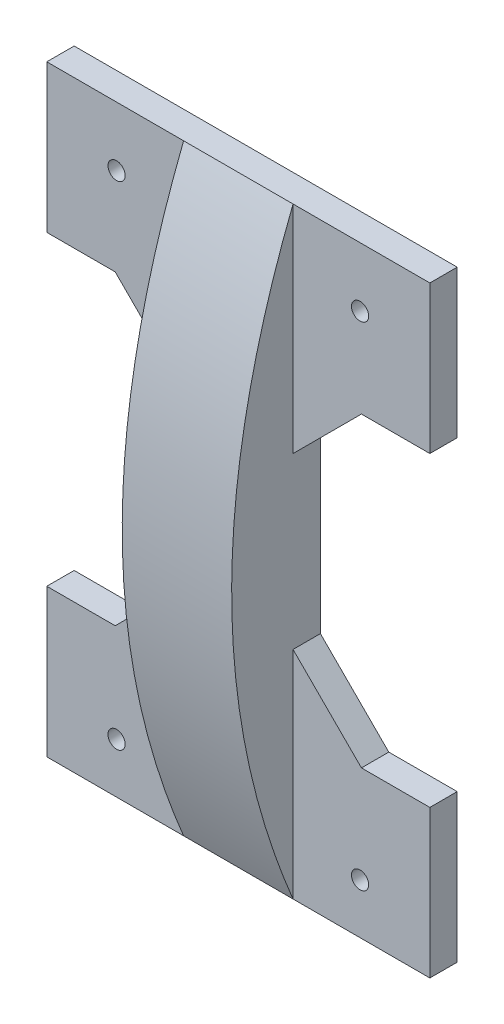
ISO-10303-21;
HEADER;
FILE_DESCRIPTION(('STEP AP214'),'2;1');
FILE_NAME('part.step','',(''),(''),'','','');
FILE_SCHEMA(('AUTOMOTIVE_DESIGN { 1 0 10303 214 1 1 1 1 }'));
ENDSEC;
DATA;
#1=APPLICATION_CONTEXT('core data for automotive mechanical design processes');
#2=APPLICATION_PROTOCOL_DEFINITION('international standard','automotive_design',2000,#1);
#3=PRODUCT_CONTEXT('',#1,'mechanical');
#4=PRODUCT('Part','Part','',(#3));
#5=PRODUCT_RELATED_PRODUCT_CATEGORY('part','',(#4));
#6=PRODUCT_DEFINITION_FORMATION('','',#4);
#7=PRODUCT_DEFINITION_CONTEXT('part definition',#1,'design');
#8=PRODUCT_DEFINITION('design','',#6,#7);
#9=PRODUCT_DEFINITION_SHAPE('','',#8);
#10=(LENGTH_UNIT() NAMED_UNIT(*) SI_UNIT(.MILLI.,.METRE.));
#11=(NAMED_UNIT(*) PLANE_ANGLE_UNIT() SI_UNIT($,.RADIAN.));
#12=(NAMED_UNIT(*) SI_UNIT($,.STERADIAN.) SOLID_ANGLE_UNIT());
#13=UNCERTAINTY_MEASURE_WITH_UNIT(LENGTH_MEASURE(1.E-05),#10,'distance_accuracy_value','');
#14=(GEOMETRIC_REPRESENTATION_CONTEXT(3) GLOBAL_UNCERTAINTY_ASSIGNED_CONTEXT((#13)) GLOBAL_UNIT_ASSIGNED_CONTEXT((#10,
#11,#12)) REPRESENTATION_CONTEXT('',''));
#15=CARTESIAN_POINT('',(0.,0.,0.));
#16=DIRECTION('',(0.,0.,1.));
#17=DIRECTION('',(1.,0.,0.));
#18=AXIS2_PLACEMENT_3D('',#15,#16,#17);
#19=CARTESIAN_POINT('',(0.,0.,5.));
#20=DIRECTION('',(0.,0.,1.));
#21=DIRECTION('',(1.,0.,0.));
#22=AXIS2_PLACEMENT_3D('',#19,#20,#21);
#23=PLANE('',#22);
#24=DIRECTION('',(0.,1.,0.));
#25=VECTOR('',#24,1.);
#26=CARTESIAN_POINT('',(-17.6713214485088,44.6574210010278,5.));
#27=LINE('',#26,#25);
#28=CARTESIAN_POINT('',(-17.6713214485088,5.15742100102772,5.));
#29=VERTEX_POINT('',#28);
#30=CARTESIAN_POINT('',(-17.6713214485088,44.6574210010278,5.));
#31=VERTEX_POINT('',#30);
#32=EDGE_CURVE('E172',#29,#31,#27,.T.);
#33=ORIENTED_EDGE('',*,*,#32,.T.);
#34=DIRECTION('',(-1.,0.,0.));
#35=VECTOR('',#34,1.);
#36=CARTESIAN_POINT('',(-42.6713214485088,44.6574210010278,5.));
#37=LINE('',#36,#35);
#38=CARTESIAN_POINT('',(-42.6713214485088,44.6574210010278,5.));
#39=VERTEX_POINT('',#38);
#40=EDGE_CURVE('E208',#31,#39,#37,.T.);
#41=ORIENTED_EDGE('',*,*,#40,.T.);
#42=DIRECTION('',(0.,-1.,0.));
#43=VECTOR('',#42,1.);
#44=CARTESIAN_POINT('',(-42.6713214485088,44.6574210010278,5.));
#45=LINE('',#44,#43);
#46=CARTESIAN_POINT('',(-42.6713214485088,17.6574210010278,5.));
#47=VERTEX_POINT('',#46);
#48=EDGE_CURVE('E203',#39,#47,#45,.T.);
#49=ORIENTED_EDGE('',*,*,#48,.T.);
#50=DIRECTION('',(-1.,0.,0.));
#51=VECTOR('',#50,1.);
#52=CARTESIAN_POINT('',(-42.6713214485088,17.6574210010278,5.));
#53=LINE('',#52,#51);
#54=CARTESIAN_POINT('',(-30.1713214485088,17.6574210010278,5.));
#55=VERTEX_POINT('',#54);
#56=EDGE_CURVE('E356',#55,#47,#53,.T.);
#57=ORIENTED_EDGE('',*,*,#56,.F.);
#58=DIRECTION('',(-0.707106781186547,0.707106781186549,0.));
#59=VECTOR('',#58,1.);
#60=CARTESIAN_POINT('',(-30.1713214485088,17.6574210010278,5.));
#61=LINE('',#60,#59);
#62=EDGE_CURVE('E371',#29,#55,#61,.T.);
#63=ORIENTED_EDGE('',*,*,#62,.F.);
#64=EDGE_LOOP('',(#33,#41,#49,#57,#63));
#65=FACE_BOUND('',#64,.T.);
#66=CARTESIAN_POINT('',(-29.9213214485088,33.8112452955171,5.));
#67=DIRECTION('',(0.,0.,1.));
#68=DIRECTION('',(1.,0.,0.));
#69=AXIS2_PLACEMENT_3D('',#66,#67,#68);
#70=CIRCLE('',#69,1.57);
#71=CARTESIAN_POINT('',(-28.3513214485088,33.8112452955171,5.));
#72=VERTEX_POINT('',#71);
#73=EDGE_CURVE('E291',#72,#72,#70,.T.);
#74=ORIENTED_EDGE('',*,*,#73,.F.);
#75=EDGE_LOOP('',(#74));
#76=FACE_BOUND('',#75,.T.);
#77=ADVANCED_FACE('F37',(#65,#76),#23,.T.);
#78=CARTESIAN_POINT('',(14.5786785514912,33.8112452955171,5.));
#79=DIRECTION('',(0.,0.,1.));
#80=DIRECTION('',(1.,0.,0.));
#81=AXIS2_PLACEMENT_3D('',#78,#79,#80);
#82=CIRCLE('',#81,1.57);
#83=CARTESIAN_POINT('',(16.1486785514912,33.8112452955171,5.));
#84=VERTEX_POINT('',#83);
#85=EDGE_CURVE('E292',#84,#84,#82,.T.);
#86=ORIENTED_EDGE('',*,*,#85,.F.);
#87=EDGE_LOOP('',(#86));
#88=FACE_BOUND('',#87,.T.);
#89=CARTESIAN_POINT('',(27.3286785514912,44.6574210010278,5.));
#90=VERTEX_POINT('',#89);
#91=CARTESIAN_POINT('',(2.32867855149122,44.6574210010278,5.));
#92=VERTEX_POINT('',#91);
#93=EDGE_CURVE('E209',#90,#92,#37,.T.);
#94=ORIENTED_EDGE('',*,*,#93,.T.);
#95=DIRECTION('',(0.,1.,0.));
#96=VECTOR('',#95,1.);
#97=CARTESIAN_POINT('',(2.32867855149122,44.6574210010278,5.));
#98=LINE('',#97,#96);
#99=CARTESIAN_POINT('',(2.32867855149122,5.1574210010279,5.));
#100=VERTEX_POINT('',#99);
#101=EDGE_CURVE('E346',#100,#92,#98,.T.);
#102=ORIENTED_EDGE('',*,*,#101,.F.);
#103=DIRECTION('',(-0.707106781186551,-0.707106781186544,0.));
#104=VECTOR('',#103,1.);
#105=CARTESIAN_POINT('',(14.8286785514912,17.6574210010278,5.));
#106=LINE('',#105,#104);
#107=CARTESIAN_POINT('',(14.8286785514912,17.6574210010278,5.));
#108=VERTEX_POINT('',#107);
#109=EDGE_CURVE('E259',#108,#100,#106,.T.);
#110=ORIENTED_EDGE('',*,*,#109,.F.);
#111=DIRECTION('',(-1.,0.,0.));
#112=VECTOR('',#111,1.);
#113=CARTESIAN_POINT('',(14.8286785514912,17.6574210010278,5.));
#114=LINE('',#113,#112);
#115=CARTESIAN_POINT('',(27.3286785514912,17.6574210010278,5.));
#116=VERTEX_POINT('',#115);
#117=EDGE_CURVE('E256',#116,#108,#114,.T.);
#118=ORIENTED_EDGE('',*,*,#117,.F.);
#119=DIRECTION('',(0.,1.,0.));
#120=VECTOR('',#119,1.);
#121=CARTESIAN_POINT('',(27.3286785514912,44.6574210010278,5.));
#122=LINE('',#121,#120);
#123=EDGE_CURVE('E199',#116,#90,#122,.T.);
#124=ORIENTED_EDGE('',*,*,#123,.T.);
#125=EDGE_LOOP('',(#94,#102,#110,#118,#124));
#126=FACE_BOUND('',#125,.T.);
#127=ADVANCED_FACE('F308',(#88,#126),#23,.T.);
#128=CARTESIAN_POINT('',(14.5786785514912,-56.1887547044829,5.));
#129=DIRECTION('',(0.,0.,1.));
#130=DIRECTION('',(1.,0.,0.));
#131=AXIS2_PLACEMENT_3D('',#128,#129,#130);
#132=CIRCLE('',#131,1.57);
#133=CARTESIAN_POINT('',(16.1486785514912,-56.1887547044829,5.));
#134=VERTEX_POINT('',#133);
#135=EDGE_CURVE('E284',#134,#134,#132,.T.);
#136=ORIENTED_EDGE('',*,*,#135,.F.);
#137=EDGE_LOOP('',(#136));
#138=FACE_BOUND('',#137,.T.);
#139=DIRECTION('',(0.707106781186551,-0.707106781186544,0.));
#140=VECTOR('',#139,1.);
#141=CARTESIAN_POINT('',(14.8286785514912,-38.3425789989722,5.));
#142=LINE('',#141,#140);
#143=CARTESIAN_POINT('',(2.32867855149122,-25.8425789989724,5.));
#144=VERTEX_POINT('',#143);
#145=CARTESIAN_POINT('',(14.8286785514912,-38.3425789989722,5.));
#146=VERTEX_POINT('',#145);
#147=EDGE_CURVE('E262',#144,#146,#142,.T.);
#148=ORIENTED_EDGE('',*,*,#147,.F.);
#149=CARTESIAN_POINT('',(2.32867855149122,-65.3425789989722,5.));
#150=VERTEX_POINT('',#149);
#151=EDGE_CURVE('E173',#150,#144,#98,.T.);
#152=ORIENTED_EDGE('',*,*,#151,.F.);
#153=DIRECTION('',(1.,0.,0.));
#154=VECTOR('',#153,1.);
#155=CARTESIAN_POINT('',(-42.6713214485088,-65.3425789989722,5.));
#156=LINE('',#155,#154);
#157=CARTESIAN_POINT('',(27.3286785514912,-65.3425789989722,5.));
#158=VERTEX_POINT('',#157);
#159=EDGE_CURVE('E192',#150,#158,#156,.T.);
#160=ORIENTED_EDGE('',*,*,#159,.T.);
#161=CARTESIAN_POINT('',(27.3286785514912,-38.3425789989722,5.));
#162=VERTEX_POINT('',#161);
#163=EDGE_CURVE('E201',#158,#162,#122,.T.);
#164=ORIENTED_EDGE('',*,*,#163,.T.);
#165=DIRECTION('',(1.,0.,0.));
#166=VECTOR('',#165,1.);
#167=CARTESIAN_POINT('',(14.8286785514912,-38.3425789989722,5.));
#168=LINE('',#167,#166);
#169=EDGE_CURVE('E265',#146,#162,#168,.T.);
#170=ORIENTED_EDGE('',*,*,#169,.F.);
#171=EDGE_LOOP('',(#148,#152,#160,#164,#170));
#172=FACE_BOUND('',#171,.T.);
#173=ADVANCED_FACE('F314',(#138,#172),#23,.T.);
#174=CARTESIAN_POINT('',(-42.6713214485088,44.6574210010278,5.));
#175=DIRECTION('',(1.,0.,0.));
#176=DIRECTION('',(0.,1.,0.));
#177=AXIS2_PLACEMENT_3D('',#174,#175,#176);
#178=PLANE('',#177);
#179=DIRECTION('',(0.,-1.,0.));
#180=VECTOR('',#179,1.);
#181=CARTESIAN_POINT('',(-42.6713214485088,44.6574210010278,0.));
#182=LINE('',#181,#180);
#183=CARTESIAN_POINT('',(-42.6713214485088,44.6574210010278,0.));
#184=VERTEX_POINT('',#183);
#185=CARTESIAN_POINT('',(-42.6713214485088,17.6574210010278,0.));
#186=VERTEX_POINT('',#185);
#187=EDGE_CURVE('E213',#184,#186,#182,.T.);
#188=ORIENTED_EDGE('',*,*,#187,.T.);
#189=DIRECTION('',(0.,0.,1.));
#190=VECTOR('',#189,1.);
#191=CARTESIAN_POINT('',(-42.6713214485088,17.6574210010278,0.));
#192=LINE('',#191,#190);
#193=EDGE_CURVE('E287',#186,#47,#192,.T.);
#194=ORIENTED_EDGE('',*,*,#193,.T.);
#195=ORIENTED_EDGE('',*,*,#48,.F.);
#196=DIRECTION('',(0.,0.,-1.));
#197=VECTOR('',#196,1.);
#198=CARTESIAN_POINT('',(-42.6713214485088,44.6574210010278,5.));
#199=LINE('',#198,#197);
#200=EDGE_CURVE('E212',#39,#184,#199,.T.);
#201=ORIENTED_EDGE('',*,*,#200,.T.);
#202=EDGE_LOOP('',(#188,#194,#195,#201));
#203=FACE_BOUND('',#202,.T.);
#204=ADVANCED_FACE('F329',(#203),#178,.F.);
#205=CARTESIAN_POINT('',(27.3286785514912,44.6574210010278,5.));
#206=DIRECTION('',(-1.,0.,0.));
#207=DIRECTION('',(0.,-1.,0.));
#208=AXIS2_PLACEMENT_3D('',#205,#206,#207);
#209=PLANE('',#208);
#210=DIRECTION('',(0.,1.,0.));
#211=VECTOR('',#210,1.);
#212=CARTESIAN_POINT('',(27.3286785514912,44.6574210010278,0.));
#213=LINE('',#212,#211);
#214=CARTESIAN_POINT('',(27.3286785514912,-65.3425789989722,0.));
#215=VERTEX_POINT('',#214);
#216=CARTESIAN_POINT('',(27.3286785514912,-38.3425789989722,0.));
#217=VERTEX_POINT('',#216);
#218=EDGE_CURVE('E220',#215,#217,#213,.T.);
#219=ORIENTED_EDGE('',*,*,#218,.T.);
#220=DIRECTION('',(0.,0.,1.));
#221=VECTOR('',#220,1.);
#222=CARTESIAN_POINT('',(27.3286785514912,-38.3425789989722,0.));
#223=LINE('',#222,#221);
#224=EDGE_CURVE('E268',#217,#162,#223,.T.);
#225=ORIENTED_EDGE('',*,*,#224,.T.);
#226=ORIENTED_EDGE('',*,*,#163,.F.);
#227=DIRECTION('',(0.,0.,-1.));
#228=VECTOR('',#227,1.);
#229=CARTESIAN_POINT('',(27.3286785514912,-65.3425789989722,5.));
#230=LINE('',#229,#228);
#231=EDGE_CURVE('E45',#158,#215,#230,.T.);
#232=ORIENTED_EDGE('',*,*,#231,.T.);
#233=EDGE_LOOP('',(#219,#225,#226,#232));
#234=FACE_BOUND('',#233,.T.);
#235=ADVANCED_FACE('F233',(#234),#209,.F.);
#236=CARTESIAN_POINT('',(-42.6713214485088,-38.3425789989722,5.));
#237=VERTEX_POINT('',#236);
#238=CARTESIAN_POINT('',(-42.6713214485088,-65.3425789989722,5.));
#239=VERTEX_POINT('',#238);
#240=EDGE_CURVE('E198',#237,#239,#45,.T.);
#241=ORIENTED_EDGE('',*,*,#240,.F.);
#242=DIRECTION('',(0.,0.,1.));
#243=VECTOR('',#242,1.);
#244=CARTESIAN_POINT('',(-42.6713214485088,-38.3425789989722,0.));
#245=LINE('',#244,#243);
#246=CARTESIAN_POINT('',(-42.6713214485088,-38.3425789989722,0.));
#247=VERTEX_POINT('',#246);
#248=EDGE_CURVE('E366',#247,#237,#245,.T.);
#249=ORIENTED_EDGE('',*,*,#248,.F.);
#250=CARTESIAN_POINT('',(-42.6713214485088,-65.3425789989722,0.));
#251=VERTEX_POINT('',#250);
#252=EDGE_CURVE('E217',#247,#251,#182,.T.);
#253=ORIENTED_EDGE('',*,*,#252,.T.);
#254=DIRECTION('',(0.,0.,-1.));
#255=VECTOR('',#254,1.);
#256=CARTESIAN_POINT('',(-42.6713214485088,-65.3425789989722,5.));
#257=LINE('',#256,#255);
#258=EDGE_CURVE('E11',#239,#251,#257,.T.);
#259=ORIENTED_EDGE('',*,*,#258,.F.);
#260=EDGE_LOOP('',(#241,#249,#253,#259));
#261=FACE_BOUND('',#260,.T.);
#262=ADVANCED_FACE('F39',(#261),#178,.F.);
#263=CARTESIAN_POINT('',(-42.6713214485088,-65.3425789989722,5.));
#264=DIRECTION('',(0.,1.,0.));
#265=DIRECTION('',(0.,0.,1.));
#266=AXIS2_PLACEMENT_3D('',#263,#264,#265);
#267=PLANE('',#266);
#268=DIRECTION('',(1.,0.,0.));
#269=VECTOR('',#268,1.);
#270=CARTESIAN_POINT('',(-42.6713214485088,-65.3425789989722,0.));
#271=LINE('',#270,#269);
#272=EDGE_CURVE('E216',#251,#215,#271,.T.);
#273=ORIENTED_EDGE('',*,*,#272,.T.);
#274=ORIENTED_EDGE('',*,*,#231,.F.);
#275=ORIENTED_EDGE('',*,*,#159,.F.);
#276=DIRECTION('',(1.,0.,0.));
#277=VECTOR('',#276,1.);
#278=CARTESIAN_POINT('',(-17.6713214485088,-65.3425789989722,5.));
#279=LINE('',#278,#277);
#280=CARTESIAN_POINT('',(-17.6713214485088,-65.3425789989722,5.));
#281=VERTEX_POINT('',#280);
#282=EDGE_CURVE('E166',#281,#150,#279,.T.);
#283=ORIENTED_EDGE('',*,*,#282,.F.);
#284=EDGE_CURVE('E189',#239,#281,#156,.T.);
#285=ORIENTED_EDGE('',*,*,#284,.F.);
#286=ORIENTED_EDGE('',*,*,#258,.T.);
#287=EDGE_LOOP('',(#273,#274,#275,#283,#285,#286));
#288=FACE_BOUND('',#287,.T.);
#289=ADVANCED_FACE('F188',(#288),#267,.F.);
#290=ORIENTED_EDGE('',*,*,#123,.F.);
#291=DIRECTION('',(0.,0.,1.));
#292=VECTOR('',#291,1.);
#293=CARTESIAN_POINT('',(27.3286785514912,17.6574210010278,0.));
#294=LINE('',#293,#292);
#295=CARTESIAN_POINT('',(27.3286785514912,17.6574210010278,0.));
#296=VERTEX_POINT('',#295);
#297=EDGE_CURVE('E248',#296,#116,#294,.T.);
#298=ORIENTED_EDGE('',*,*,#297,.F.);
#299=CARTESIAN_POINT('',(27.3286785514912,44.6574210010278,0.));
#300=VERTEX_POINT('',#299);
#301=EDGE_CURVE('E219',#296,#300,#213,.T.);
#302=ORIENTED_EDGE('',*,*,#301,.T.);
#303=DIRECTION('',(0.,0.,-1.));
#304=VECTOR('',#303,1.);
#305=CARTESIAN_POINT('',(27.3286785514912,44.6574210010278,5.));
#306=LINE('',#305,#304);
#307=EDGE_CURVE('E227',#90,#300,#306,.T.);
#308=ORIENTED_EDGE('',*,*,#307,.F.);
#309=EDGE_LOOP('',(#290,#298,#302,#308));
#310=FACE_BOUND('',#309,.T.);
#311=ADVANCED_FACE('F325',(#310),#209,.F.);
#312=CARTESIAN_POINT('',(-42.6713214485088,44.6574210010278,5.));
#313=DIRECTION('',(0.,-1.,0.));
#314=DIRECTION('',(0.,0.,-1.));
#315=AXIS2_PLACEMENT_3D('',#312,#313,#314);
#316=PLANE('',#315);
#317=DIRECTION('',(-1.,0.,0.));
#318=VECTOR('',#317,1.);
#319=CARTESIAN_POINT('',(-42.6713214485088,44.6574210010278,0.));
#320=LINE('',#319,#318);
#321=EDGE_CURVE('E223',#300,#184,#320,.T.);
#322=ORIENTED_EDGE('',*,*,#321,.T.);
#323=ORIENTED_EDGE('',*,*,#200,.F.);
#324=ORIENTED_EDGE('',*,*,#40,.F.);
#325=DIRECTION('',(1.,0.,0.));
#326=VECTOR('',#325,1.);
#327=CARTESIAN_POINT('',(-17.6713214485088,44.6574210010278,5.));
#328=LINE('',#327,#326);
#329=EDGE_CURVE('E169',#31,#92,#328,.T.);
#330=ORIENTED_EDGE('',*,*,#329,.T.);
#331=ORIENTED_EDGE('',*,*,#93,.F.);
#332=ORIENTED_EDGE('',*,*,#307,.T.);
#333=EDGE_LOOP('',(#322,#323,#324,#330,#331,#332));
#334=FACE_BOUND('',#333,.T.);
#335=ADVANCED_FACE('F319',(#334),#316,.F.);
#336=CARTESIAN_POINT('',(-17.6713214485088,-25.8425789989722,5.));
#337=VERTEX_POINT('',#336);
#338=EDGE_CURVE('E176',#281,#337,#27,.T.);
#339=ORIENTED_EDGE('',*,*,#338,.T.);
#340=DIRECTION('',(0.707106781186546,0.707106781186549,0.));
#341=VECTOR('',#340,1.);
#342=CARTESIAN_POINT('',(-30.1713214485088,-38.3425789989722,5.));
#343=LINE('',#342,#341);
#344=CARTESIAN_POINT('',(-30.1713214485088,-38.3425789989722,5.));
#345=VERTEX_POINT('',#344);
#346=EDGE_CURVE('E369',#345,#337,#343,.T.);
#347=ORIENTED_EDGE('',*,*,#346,.F.);
#348=DIRECTION('',(1.,0.,0.));
#349=VECTOR('',#348,1.);
#350=CARTESIAN_POINT('',(-42.6713214485088,-38.3425789989722,5.));
#351=LINE('',#350,#349);
#352=EDGE_CURVE('E270',#237,#345,#351,.T.);
#353=ORIENTED_EDGE('',*,*,#352,.F.);
#354=ORIENTED_EDGE('',*,*,#240,.T.);
#355=ORIENTED_EDGE('',*,*,#284,.T.);
#356=EDGE_LOOP('',(#339,#347,#353,#354,#355));
#357=FACE_BOUND('',#356,.T.);
#358=CARTESIAN_POINT('',(-29.9213214485088,-56.1887547044829,5.));
#359=DIRECTION('',(0.,0.,1.));
#360=DIRECTION('',(1.,0.,0.));
#361=AXIS2_PLACEMENT_3D('',#358,#359,#360);
#362=CIRCLE('',#361,1.57);
#363=CARTESIAN_POINT('',(-28.3513214485088,-56.1887547044829,5.));
#364=VERTEX_POINT('',#363);
#365=EDGE_CURVE('E283',#364,#364,#362,.T.);
#366=ORIENTED_EDGE('',*,*,#365,.F.);
#367=EDGE_LOOP('',(#366));
#368=FACE_BOUND('',#367,.T.);
#369=ADVANCED_FACE('F194',(#357,#368),#23,.T.);
#370=CARTESIAN_POINT('',(0.,0.,0.));
#371=DIRECTION('',(0.,0.,1.));
#372=DIRECTION('',(1.,0.,0.));
#373=AXIS2_PLACEMENT_3D('',#370,#371,#372);
#374=PLANE('',#373);
#375=CARTESIAN_POINT('',(14.5786785514912,33.8112452955171,0.));
#376=DIRECTION('',(0.,0.,1.));
#377=DIRECTION('',(1.,0.,0.));
#378=AXIS2_PLACEMENT_3D('',#375,#376,#377);
#379=CIRCLE('',#378,1.57);
#380=CARTESIAN_POINT('',(16.1486785514912,33.8112452955171,0.));
#381=VERTEX_POINT('',#380);
#382=EDGE_CURVE('E288',#381,#381,#379,.T.);
#383=ORIENTED_EDGE('',*,*,#382,.T.);
#384=EDGE_LOOP('',(#383));
#385=FACE_BOUND('',#384,.T.);
#386=CARTESIAN_POINT('',(-29.9213214485088,-56.1887547044829,0.));
#387=DIRECTION('',(0.,0.,1.));
#388=DIRECTION('',(1.,0.,0.));
#389=AXIS2_PLACEMENT_3D('',#386,#387,#388);
#390=CIRCLE('',#389,1.57);
#391=CARTESIAN_POINT('',(-28.3513214485088,-56.1887547044829,0.));
#392=VERTEX_POINT('',#391);
#393=EDGE_CURVE('E295',#392,#392,#390,.T.);
#394=ORIENTED_EDGE('',*,*,#393,.T.);
#395=EDGE_LOOP('',(#394));
#396=FACE_BOUND('',#395,.T.);
#397=CARTESIAN_POINT('',(14.5786785514912,-56.1887547044829,0.));
#398=DIRECTION('',(0.,0.,1.));
#399=DIRECTION('',(1.,0.,0.));
#400=AXIS2_PLACEMENT_3D('',#397,#398,#399);
#401=CIRCLE('',#400,1.57);
#402=CARTESIAN_POINT('',(16.1486785514912,-56.1887547044829,0.));
#403=VERTEX_POINT('',#402);
#404=EDGE_CURVE('E280',#403,#403,#401,.T.);
#405=ORIENTED_EDGE('',*,*,#404,.T.);
#406=EDGE_LOOP('',(#405));
#407=FACE_BOUND('',#406,.T.);
#408=CARTESIAN_POINT('',(-29.9213214485088,33.8112452955171,0.));
#409=DIRECTION('',(0.,0.,1.));
#410=DIRECTION('',(1.,0.,0.));
#411=AXIS2_PLACEMENT_3D('',#408,#409,#410);
#412=CIRCLE('',#411,1.57);
#413=CARTESIAN_POINT('',(-28.3513214485088,33.8112452955171,0.));
#414=VERTEX_POINT('',#413);
#415=EDGE_CURVE('E300',#414,#414,#412,.T.);
#416=ORIENTED_EDGE('',*,*,#415,.T.);
#417=EDGE_LOOP('',(#416));
#418=FACE_BOUND('',#417,.T.);
#419=DIRECTION('',(-0.707106781186547,0.707106781186549,0.));
#420=VECTOR('',#419,1.);
#421=CARTESIAN_POINT('',(-30.1713214485088,17.6574210010278,0.));
#422=LINE('',#421,#420);
#423=CARTESIAN_POINT('',(-17.6713214485088,5.15742100102772,0.));
#424=VERTEX_POINT('',#423);
#425=CARTESIAN_POINT('',(-30.1713214485088,17.6574210010278,0.));
#426=VERTEX_POINT('',#425);
#427=EDGE_CURVE('E361',#424,#426,#422,.T.);
#428=ORIENTED_EDGE('',*,*,#427,.T.);
#429=DIRECTION('',(-1.,0.,0.));
#430=VECTOR('',#429,1.);
#431=CARTESIAN_POINT('',(-42.6713214485088,17.6574210010278,0.));
#432=LINE('',#431,#430);
#433=EDGE_CURVE('E363',#426,#186,#432,.T.);
#434=ORIENTED_EDGE('',*,*,#433,.T.);
#435=ORIENTED_EDGE('',*,*,#187,.F.);
#436=ORIENTED_EDGE('',*,*,#321,.F.);
#437=ORIENTED_EDGE('',*,*,#301,.F.);
#438=DIRECTION('',(-1.,0.,0.));
#439=VECTOR('',#438,1.);
#440=CARTESIAN_POINT('',(14.8286785514912,17.6574210010278,0.));
#441=LINE('',#440,#439);
#442=CARTESIAN_POINT('',(14.8286785514912,17.6574210010278,0.));
#443=VERTEX_POINT('',#442);
#444=EDGE_CURVE('E267',#296,#443,#441,.T.);
#445=ORIENTED_EDGE('',*,*,#444,.T.);
#446=DIRECTION('',(-0.707106781186551,-0.707106781186544,0.));
#447=VECTOR('',#446,1.);
#448=CARTESIAN_POINT('',(14.8286785514912,17.6574210010278,0.));
#449=LINE('',#448,#447);
#450=CARTESIAN_POINT('',(2.32867855149122,5.15742100102789,0.));
#451=VERTEX_POINT('',#450);
#452=EDGE_CURVE('E60',#443,#451,#449,.T.);
#453=ORIENTED_EDGE('',*,*,#452,.T.);
#454=DIRECTION('',(0.,-1.,0.));
#455=VECTOR('',#454,1.);
#456=CARTESIAN_POINT('',(2.32867855149122,5.15742100102789,0.));
#457=LINE('',#456,#455);
#458=CARTESIAN_POINT('',(2.32867855149122,-25.8425789989724,0.));
#459=VERTEX_POINT('',#458);
#460=EDGE_CURVE('E252',#451,#459,#457,.T.);
#461=ORIENTED_EDGE('',*,*,#460,.T.);
#462=DIRECTION('',(0.707106781186551,-0.707106781186544,0.));
#463=VECTOR('',#462,1.);
#464=CARTESIAN_POINT('',(14.8286785514912,-38.3425789989722,0.));
#465=LINE('',#464,#463);
#466=CARTESIAN_POINT('',(14.8286785514912,-38.3425789989722,0.));
#467=VERTEX_POINT('',#466);
#468=EDGE_CURVE('E246',#459,#467,#465,.T.);
#469=ORIENTED_EDGE('',*,*,#468,.T.);
#470=DIRECTION('',(1.,0.,0.));
#471=VECTOR('',#470,1.);
#472=CARTESIAN_POINT('',(14.8286785514912,-38.3425789989722,0.));
#473=LINE('',#472,#471);
#474=EDGE_CURVE('E243',#467,#217,#473,.T.);
#475=ORIENTED_EDGE('',*,*,#474,.T.);
#476=ORIENTED_EDGE('',*,*,#218,.F.);
#477=ORIENTED_EDGE('',*,*,#272,.F.);
#478=ORIENTED_EDGE('',*,*,#252,.F.);
#479=DIRECTION('',(1.,0.,0.));
#480=VECTOR('',#479,1.);
#481=CARTESIAN_POINT('',(-42.6713214485088,-38.3425789989722,0.));
#482=LINE('',#481,#480);
#483=CARTESIAN_POINT('',(-30.1713214485088,-38.3425789989722,0.));
#484=VERTEX_POINT('',#483);
#485=EDGE_CURVE('E353',#247,#484,#482,.T.);
#486=ORIENTED_EDGE('',*,*,#485,.T.);
#487=DIRECTION('',(0.707106781186546,0.707106781186549,0.));
#488=VECTOR('',#487,1.);
#489=CARTESIAN_POINT('',(-30.1713214485088,-38.3425789989722,0.));
#490=LINE('',#489,#488);
#491=CARTESIAN_POINT('',(-17.6713214485088,-25.8425789989722,0.));
#492=VERTEX_POINT('',#491);
#493=EDGE_CURVE('E52',#484,#492,#490,.T.);
#494=ORIENTED_EDGE('',*,*,#493,.T.);
#495=DIRECTION('',(0.,1.,0.));
#496=VECTOR('',#495,1.);
#497=CARTESIAN_POINT('',(-17.6713214485088,5.15742100102772,0.));
#498=LINE('',#497,#496);
#499=EDGE_CURVE('E358',#492,#424,#498,.T.);
#500=ORIENTED_EDGE('',*,*,#499,.T.);
#501=EDGE_LOOP('',(#428,#434,#435,#436,#437,#445,#453,#461,#469,#475,#476,#477,#478,#486,#494,#500));
#502=FACE_BOUND('',#501,.T.);
#503=ADVANCED_FACE('F239',(#385,#396,#407,#418,#502),#374,.F.);
#504=CARTESIAN_POINT('',(-29.9213214485088,33.8112452955171,0.));
#505=DIRECTION('',(0.,0.,1.));
#506=DIRECTION('',(1.,0.,0.));
#507=AXIS2_PLACEMENT_3D('',#504,#505,#506);
#508=CYLINDRICAL_SURFACE('',#507,1.57);
#509=ORIENTED_EDGE('',*,*,#415,.F.);
#510=EDGE_LOOP('',(#509));
#511=FACE_BOUND('',#510,.T.);
#512=ORIENTED_EDGE('',*,*,#73,.T.);
#513=EDGE_LOOP('',(#512));
#514=FACE_BOUND('',#513,.T.);
#515=ADVANCED_FACE('F305',(#511,#514),#508,.F.);
#516=CARTESIAN_POINT('',(14.5786785514912,-56.1887547044829,0.));
#517=DIRECTION('',(0.,0.,1.));
#518=DIRECTION('',(1.,0.,0.));
#519=AXIS2_PLACEMENT_3D('',#516,#517,#518);
#520=CYLINDRICAL_SURFACE('',#519,1.57);
#521=ORIENTED_EDGE('',*,*,#404,.F.);
#522=EDGE_LOOP('',(#521));
#523=FACE_BOUND('',#522,.T.);
#524=ORIENTED_EDGE('',*,*,#135,.T.);
#525=EDGE_LOOP('',(#524));
#526=FACE_BOUND('',#525,.T.);
#527=ADVANCED_FACE('F445',(#523,#526),#520,.F.);
#528=CARTESIAN_POINT('',(-29.9213214485088,-56.1887547044829,0.));
#529=DIRECTION('',(0.,0.,1.));
#530=DIRECTION('',(1.,0.,0.));
#531=AXIS2_PLACEMENT_3D('',#528,#529,#530);
#532=CYLINDRICAL_SURFACE('',#531,1.57);
#533=ORIENTED_EDGE('',*,*,#393,.F.);
#534=EDGE_LOOP('',(#533));
#535=FACE_BOUND('',#534,.T.);
#536=ORIENTED_EDGE('',*,*,#365,.T.);
#537=EDGE_LOOP('',(#536));
#538=FACE_BOUND('',#537,.T.);
#539=ADVANCED_FACE('F448',(#535,#538),#532,.F.);
#540=CARTESIAN_POINT('',(14.5786785514912,33.8112452955171,0.));
#541=DIRECTION('',(0.,0.,1.));
#542=DIRECTION('',(1.,0.,0.));
#543=AXIS2_PLACEMENT_3D('',#540,#541,#542);
#544=CYLINDRICAL_SURFACE('',#543,1.57);
#545=ORIENTED_EDGE('',*,*,#382,.F.);
#546=EDGE_LOOP('',(#545));
#547=FACE_BOUND('',#546,.T.);
#548=ORIENTED_EDGE('',*,*,#85,.T.);
#549=EDGE_LOOP('',(#548));
#550=FACE_BOUND('',#549,.T.);
#551=ADVANCED_FACE('F436',(#547,#550),#544,.F.);
#552=CARTESIAN_POINT('',(14.8286785514912,-38.3425789989722,0.));
#553=DIRECTION('',(0.,-1.,0.));
#554=DIRECTION('',(0.,0.,-1.));
#555=AXIS2_PLACEMENT_3D('',#552,#553,#554);
#556=PLANE('',#555);
#557=ORIENTED_EDGE('',*,*,#169,.T.);
#558=ORIENTED_EDGE('',*,*,#224,.F.);
#559=ORIENTED_EDGE('',*,*,#474,.F.);
#560=DIRECTION('',(0.,0.,1.));
#561=VECTOR('',#560,1.);
#562=CARTESIAN_POINT('',(14.8286785514912,-38.3425789989722,0.));
#563=LINE('',#562,#561);
#564=EDGE_CURVE('E271',#467,#146,#563,.T.);
#565=ORIENTED_EDGE('',*,*,#564,.T.);
#566=EDGE_LOOP('',(#557,#558,#559,#565));
#567=FACE_BOUND('',#566,.T.);
#568=ADVANCED_FACE('F433',(#567),#556,.F.);
#569=CARTESIAN_POINT('',(14.8286785514912,-38.3425789989722,0.));
#570=DIRECTION('',(-0.707106781186544,-0.707106781186551,0.));
#571=DIRECTION('',(0.707106781186551,-0.707106781186544,0.));
#572=AXIS2_PLACEMENT_3D('',#569,#570,#571);
#573=PLANE('',#572);
#574=ORIENTED_EDGE('',*,*,#147,.T.);
#575=ORIENTED_EDGE('',*,*,#564,.F.);
#576=ORIENTED_EDGE('',*,*,#468,.F.);
#577=DIRECTION('',(0.,0.,1.));
#578=VECTOR('',#577,1.);
#579=CARTESIAN_POINT('',(2.32867855149122,-25.8425789989724,0.));
#580=LINE('',#579,#578);
#581=EDGE_CURVE('E273',#459,#144,#580,.T.);
#582=ORIENTED_EDGE('',*,*,#581,.T.);
#583=EDGE_LOOP('',(#574,#575,#576,#582));
#584=FACE_BOUND('',#583,.T.);
#585=ADVANCED_FACE('F341',(#584),#573,.F.);
#586=CARTESIAN_POINT('',(2.32867855149122,5.15742100102789,0.));
#587=DIRECTION('',(-1.,0.,0.));
#588=DIRECTION('',(0.,0.,1.));
#589=AXIS2_PLACEMENT_3D('',#586,#587,#588);
#590=PLANE('',#589);
#591=DIRECTION('',(0.,0.,1.));
#592=VECTOR('',#591,1.);
#593=CARTESIAN_POINT('',(2.32867855149122,5.15742100102789,0.));
#594=LINE('',#593,#592);
#595=EDGE_CURVE('E276',#451,#100,#594,.T.);
#596=ORIENTED_EDGE('',*,*,#595,.T.);
#597=ORIENTED_EDGE('',*,*,#101,.T.);
#598=CARTESIAN_POINT('',(2.32867855149122,44.6574210010278,5.));
#599=CARTESIAN_POINT('',(2.32867855149122,-11.8555166429066,27.4316517700386));
#600=CARTESIAN_POINT('',(2.32867855149122,-65.3425789989722,4.99999999999999));
#601=B_SPLINE_CURVE_WITH_KNOTS('',2,(#598,#599,#600),.UNSPECIFIED.,.F.,.F.,(3,3),(0.,1.),.UNSPECIFIED.);
#602=EDGE_CURVE('E345',#92,#150,#601,.T.);
#603=ORIENTED_EDGE('',*,*,#602,.T.);
#604=ORIENTED_EDGE('',*,*,#151,.T.);
#605=ORIENTED_EDGE('',*,*,#581,.F.);
#606=ORIENTED_EDGE('',*,*,#460,.F.);
#607=EDGE_LOOP('',(#596,#597,#603,#604,#605,#606));
#608=FACE_BOUND('',#607,.T.);
#609=ADVANCED_FACE('F344',(#608),#590,.F.);
#610=CARTESIAN_POINT('',(14.8286785514912,17.6574210010278,0.));
#611=DIRECTION('',(-0.707106781186544,0.707106781186551,0.));
#612=DIRECTION('',(-0.707106781186551,-0.707106781186544,0.));
#613=AXIS2_PLACEMENT_3D('',#610,#611,#612);
#614=PLANE('',#613);
#615=ORIENTED_EDGE('',*,*,#109,.T.);
#616=ORIENTED_EDGE('',*,*,#595,.F.);
#617=ORIENTED_EDGE('',*,*,#452,.F.);
#618=DIRECTION('',(0.,0.,1.));
#619=VECTOR('',#618,1.);
#620=CARTESIAN_POINT('',(14.8286785514912,17.6574210010278,0.));
#621=LINE('',#620,#619);
#622=EDGE_CURVE('E250',#443,#108,#621,.T.);
#623=ORIENTED_EDGE('',*,*,#622,.T.);
#624=EDGE_LOOP('',(#615,#616,#617,#623));
#625=FACE_BOUND('',#624,.T.);
#626=ADVANCED_FACE('F400',(#625),#614,.F.);
#627=CARTESIAN_POINT('',(14.8286785514912,17.6574210010278,0.));
#628=DIRECTION('',(0.,1.,0.));
#629=DIRECTION('',(0.,0.,1.));
#630=AXIS2_PLACEMENT_3D('',#627,#628,#629);
#631=PLANE('',#630);
#632=ORIENTED_EDGE('',*,*,#117,.T.);
#633=ORIENTED_EDGE('',*,*,#622,.F.);
#634=ORIENTED_EDGE('',*,*,#444,.F.);
#635=ORIENTED_EDGE('',*,*,#297,.T.);
#636=EDGE_LOOP('',(#632,#633,#634,#635));
#637=FACE_BOUND('',#636,.T.);
#638=ADVANCED_FACE('F392',(#637),#631,.F.);
#639=CARTESIAN_POINT('',(-42.6713214485088,17.6574210010278,0.));
#640=DIRECTION('',(0.,1.,0.));
#641=DIRECTION('',(0.,0.,1.));
#642=AXIS2_PLACEMENT_3D('',#639,#640,#641);
#643=PLANE('',#642);
#644=ORIENTED_EDGE('',*,*,#56,.T.);
#645=ORIENTED_EDGE('',*,*,#193,.F.);
#646=ORIENTED_EDGE('',*,*,#433,.F.);
#647=DIRECTION('',(0.,0.,1.));
#648=VECTOR('',#647,1.);
#649=CARTESIAN_POINT('',(-30.1713214485088,17.6574210010278,0.));
#650=LINE('',#649,#648);
#651=EDGE_CURVE('E377',#426,#55,#650,.T.);
#652=ORIENTED_EDGE('',*,*,#651,.T.);
#653=EDGE_LOOP('',(#644,#645,#646,#652));
#654=FACE_BOUND('',#653,.T.);
#655=ADVANCED_FACE('F417',(#654),#643,.F.);
#656=CARTESIAN_POINT('',(-30.1713214485088,17.6574210010278,0.));
#657=DIRECTION('',(0.707106781186549,0.707106781186547,0.));
#658=DIRECTION('',(-0.707106781186546,0.707106781186549,0.));
#659=AXIS2_PLACEMENT_3D('',#656,#657,#658);
#660=PLANE('',#659);
#661=ORIENTED_EDGE('',*,*,#62,.T.);
#662=ORIENTED_EDGE('',*,*,#651,.F.);
#663=ORIENTED_EDGE('',*,*,#427,.F.);
#664=DIRECTION('',(0.,0.,1.));
#665=VECTOR('',#664,1.);
#666=CARTESIAN_POINT('',(-17.6713214485088,5.15742100102772,0.));
#667=LINE('',#666,#665);
#668=EDGE_CURVE('E379',#424,#29,#667,.T.);
#669=ORIENTED_EDGE('',*,*,#668,.T.);
#670=EDGE_LOOP('',(#661,#662,#663,#669));
#671=FACE_BOUND('',#670,.T.);
#672=ADVANCED_FACE('F420',(#671),#660,.F.);
#673=CARTESIAN_POINT('',(-17.6713214485088,5.15742100102772,0.));
#674=DIRECTION('',(1.,0.,0.));
#675=DIRECTION('',(0.,1.,0.));
#676=AXIS2_PLACEMENT_3D('',#673,#674,#675);
#677=PLANE('',#676);
#678=DIRECTION('',(0.,0.,1.));
#679=VECTOR('',#678,1.);
#680=CARTESIAN_POINT('',(-17.6713214485088,-25.8425789989722,0.));
#681=LINE('',#680,#679);
#682=EDGE_CURVE('E179',#492,#337,#681,.T.);
#683=ORIENTED_EDGE('',*,*,#682,.T.);
#684=ORIENTED_EDGE('',*,*,#338,.F.);
#685=CARTESIAN_POINT('',(-17.6713214485088,44.6574210010278,5.));
#686=CARTESIAN_POINT('',(-17.6713214485088,-11.8555166429066,27.4316517700386));
#687=CARTESIAN_POINT('',(-17.6713214485088,-65.3425789989722,4.99999999999999));
#688=B_SPLINE_CURVE_WITH_KNOTS('',2,(#685,#686,#687),.UNSPECIFIED.,.F.,.F.,(3,3),(0.,1.),.UNSPECIFIED.);
#689=EDGE_CURVE('E161',#31,#281,#688,.T.);
#690=ORIENTED_EDGE('',*,*,#689,.F.);
#691=ORIENTED_EDGE('',*,*,#32,.F.);
#692=ORIENTED_EDGE('',*,*,#668,.F.);
#693=ORIENTED_EDGE('',*,*,#499,.F.);
#694=EDGE_LOOP('',(#683,#684,#690,#691,#692,#693));
#695=FACE_BOUND('',#694,.T.);
#696=ADVANCED_FACE('F177',(#695),#677,.F.);
#697=CARTESIAN_POINT('',(-30.1713214485088,-38.3425789989722,0.));
#698=DIRECTION('',(0.707106781186549,-0.707106781186546,0.));
#699=DIRECTION('',(0.707106781186546,0.707106781186549,0.));
#700=AXIS2_PLACEMENT_3D('',#697,#698,#699);
#701=PLANE('',#700);
#702=ORIENTED_EDGE('',*,*,#346,.T.);
#703=ORIENTED_EDGE('',*,*,#682,.F.);
#704=ORIENTED_EDGE('',*,*,#493,.F.);
#705=DIRECTION('',(0.,0.,1.));
#706=VECTOR('',#705,1.);
#707=CARTESIAN_POINT('',(-30.1713214485088,-38.3425789989722,0.));
#708=LINE('',#707,#706);
#709=EDGE_CURVE('E383',#484,#345,#708,.T.);
#710=ORIENTED_EDGE('',*,*,#709,.T.);
#711=EDGE_LOOP('',(#702,#703,#704,#710));
#712=FACE_BOUND('',#711,.T.);
#713=ADVANCED_FACE('F427',(#712),#701,.F.);
#714=CARTESIAN_POINT('',(-42.6713214485088,-38.3425789989722,0.));
#715=DIRECTION('',(0.,-1.,0.));
#716=DIRECTION('',(0.,0.,-1.));
#717=AXIS2_PLACEMENT_3D('',#714,#715,#716);
#718=PLANE('',#717);
#719=ORIENTED_EDGE('',*,*,#352,.T.);
#720=ORIENTED_EDGE('',*,*,#709,.F.);
#721=ORIENTED_EDGE('',*,*,#485,.F.);
#722=ORIENTED_EDGE('',*,*,#248,.T.);
#723=EDGE_LOOP('',(#719,#720,#721,#722));
#724=FACE_BOUND('',#723,.T.);
#725=ADVANCED_FACE('F416',(#724),#718,.F.);
#726=DIRECTION('',(1.,0.,0.));
#727=VECTOR('',#726,1.);
#728=SURFACE_OF_LINEAR_EXTRUSION('',#688,#727);
#729=ORIENTED_EDGE('',*,*,#602,.F.);
#730=ORIENTED_EDGE('',*,*,#329,.F.);
#731=ORIENTED_EDGE('',*,*,#689,.T.);
#732=ORIENTED_EDGE('',*,*,#282,.T.);
#733=EDGE_LOOP('',(#729,#730,#731,#732));
#734=FACE_BOUND('',#733,.T.);
#735=ADVANCED_FACE('F164',(#734),#728,.T.);
#736=CLOSED_SHELL('',(#77,#127,#173,#204,#235,#262,#289,#311,#335,#369,#503,#515,#527,#539,#551,
#568,#585,#609,#626,#638,#655,#672,#696,#713,#725,#735));
#737=MANIFOLD_SOLID_BREP('B2',#736);
#738=ADVANCED_BREP_SHAPE_REPRESENTATION('',(#18,#737),#14);
#739=SHAPE_DEFINITION_REPRESENTATION(#9,#738);
ENDSEC;
END-ISO-10303-21;
